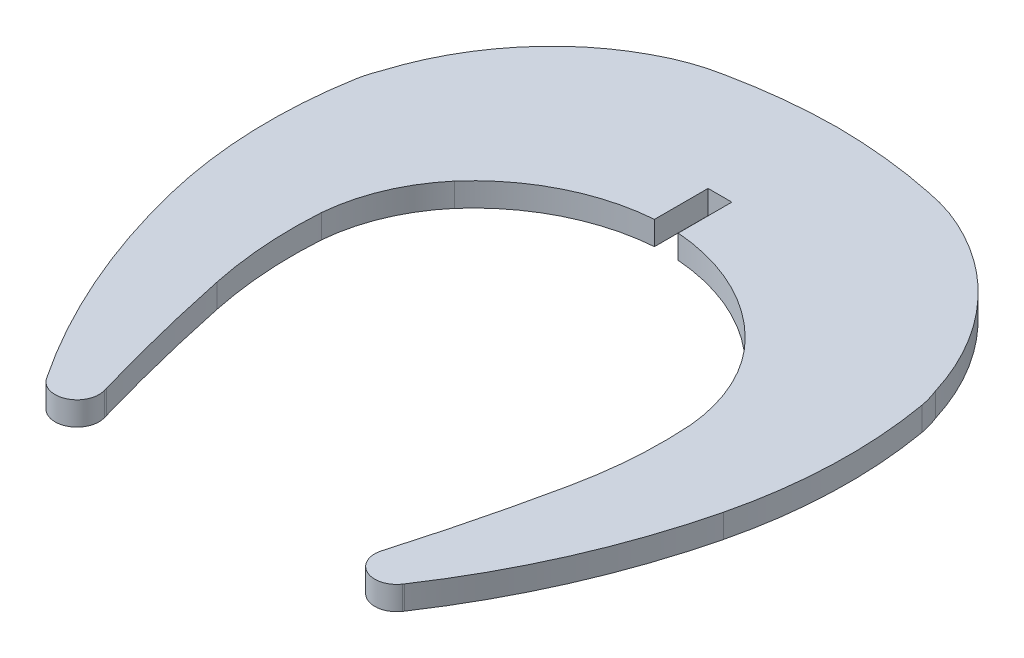
ISO-10303-21;
HEADER;
FILE_DESCRIPTION(('STEP AP214'),'2;1');
FILE_NAME('part.step','',(''),(''),'','','');
FILE_SCHEMA(('AUTOMOTIVE_DESIGN { 1 0 10303 214 1 1 1 1 }'));
ENDSEC;
DATA;
#1=APPLICATION_CONTEXT('core data for automotive mechanical design processes');
#2=APPLICATION_PROTOCOL_DEFINITION('international standard','automotive_design',2000,#1);
#3=PRODUCT_CONTEXT('',#1,'mechanical');
#4=PRODUCT('Part','Part','',(#3));
#5=PRODUCT_RELATED_PRODUCT_CATEGORY('part','',(#4));
#6=PRODUCT_DEFINITION_FORMATION('','',#4);
#7=PRODUCT_DEFINITION_CONTEXT('part definition',#1,'design');
#8=PRODUCT_DEFINITION('design','',#6,#7);
#9=PRODUCT_DEFINITION_SHAPE('','',#8);
#10=(LENGTH_UNIT() NAMED_UNIT(*) SI_UNIT(.MILLI.,.METRE.));
#11=(NAMED_UNIT(*) PLANE_ANGLE_UNIT() SI_UNIT($,.RADIAN.));
#12=(NAMED_UNIT(*) SI_UNIT($,.STERADIAN.) SOLID_ANGLE_UNIT());
#13=UNCERTAINTY_MEASURE_WITH_UNIT(LENGTH_MEASURE(1.E-05),#10,'distance_accuracy_value','');
#14=(GEOMETRIC_REPRESENTATION_CONTEXT(3) GLOBAL_UNCERTAINTY_ASSIGNED_CONTEXT((#13)) GLOBAL_UNIT_ASSIGNED_CONTEXT((#10,
#11,#12)) REPRESENTATION_CONTEXT('',''));
#15=CARTESIAN_POINT('',(0.,0.,0.));
#16=DIRECTION('',(0.,0.,1.));
#17=DIRECTION('',(1.,0.,0.));
#18=AXIS2_PLACEMENT_3D('',#15,#16,#17);
#19=CARTESIAN_POINT('',(180.345406971849,1.45,-372.869788526125));
#20=DIRECTION('',(0.,-1.,0.));
#21=DIRECTION('',(0.,0.,-1.));
#22=AXIS2_PLACEMENT_3D('',#19,#20,#21);
#23=CYLINDRICAL_SURFACE('',#22,10.6520191429131);
#24=CARTESIAN_POINT('',(180.345406971849,0.,-372.869788526125));
#25=DIRECTION('',(0.,1.,0.));
#26=DIRECTION('',(0.,0.,1.));
#27=AXIS2_PLACEMENT_3D('',#24,#25,#26);
#28=CIRCLE('',#27,10.6520191429131);
#29=CARTESIAN_POINT('',(184.776584593496,0.,-382.55638631412));
#30=VERTEX_POINT('',#29);
#31=CARTESIAN_POINT('',(182.253801492702,0.,-383.349461334651));
#32=VERTEX_POINT('',#31);
#33=EDGE_CURVE('E271',#30,#32,#28,.T.);
#34=ORIENTED_EDGE('',*,*,#33,.T.);
#35=DIRECTION('',(0.,-1.,0.));
#36=VECTOR('',#35,1.);
#37=CARTESIAN_POINT('',(182.253801492702,1.45,-383.349461334651));
#38=LINE('',#37,#36);
#39=CARTESIAN_POINT('',(182.253801492702,1.45,-383.349461334651));
#40=VERTEX_POINT('',#39);
#41=EDGE_CURVE('E11',#40,#32,#38,.T.);
#42=ORIENTED_EDGE('',*,*,#41,.F.);
#43=CARTESIAN_POINT('',(180.345406971849,1.45,-372.869788526125));
#44=DIRECTION('',(0.,1.,0.));
#45=DIRECTION('',(0.,0.,1.));
#46=AXIS2_PLACEMENT_3D('',#43,#44,#45);
#47=CIRCLE('',#46,10.6520191429131);
#48=CARTESIAN_POINT('',(184.776584593496,1.45,-382.55638631412));
#49=VERTEX_POINT('',#48);
#50=EDGE_CURVE('E344',#49,#40,#47,.T.);
#51=ORIENTED_EDGE('',*,*,#50,.F.);
#52=DIRECTION('',(0.,-1.,0.));
#53=VECTOR('',#52,1.);
#54=CARTESIAN_POINT('',(184.776584593496,1.45,-382.55638631412));
#55=LINE('',#54,#53);
#56=EDGE_CURVE('E267',#49,#30,#55,.T.);
#57=ORIENTED_EDGE('',*,*,#56,.T.);
#58=EDGE_LOOP('',(#34,#42,#51,#57));
#59=FACE_BOUND('',#58,.T.);
#60=ADVANCED_FACE('F37',(#59),#23,.T.);
#61=CARTESIAN_POINT('',(175.785924240257,1.45,-352.59396874766));
#62=DIRECTION('',(0.,-1.,0.));
#63=DIRECTION('',(0.,0.,-1.));
#64=AXIS2_PLACEMENT_3D('',#61,#62,#63);
#65=CYLINDRICAL_SURFACE('',#64,31.42823190097);
#66=CARTESIAN_POINT('',(175.785924240257,0.,-352.59396874766));
#67=DIRECTION('',(0.,1.,0.));
#68=DIRECTION('',(0.,0.,1.));
#69=AXIS2_PLACEMENT_3D('',#66,#67,#68);
#70=CIRCLE('',#69,31.42823190097);
#71=CARTESIAN_POINT('',(175.986030991978,0.,-384.021563592145));
#72=VERTEX_POINT('',#71);
#73=EDGE_CURVE('E274',#32,#72,#70,.T.);
#74=ORIENTED_EDGE('',*,*,#73,.T.);
#75=DIRECTION('',(0.,-1.,0.));
#76=VECTOR('',#75,1.);
#77=CARTESIAN_POINT('',(175.986030991978,1.45,-384.021563592145));
#78=LINE('',#77,#76);
#79=CARTESIAN_POINT('',(175.986030991978,1.45,-384.021563592145));
#80=VERTEX_POINT('',#79);
#81=EDGE_CURVE('E45',#80,#72,#78,.T.);
#82=ORIENTED_EDGE('',*,*,#81,.F.);
#83=CARTESIAN_POINT('',(175.785924240257,1.45,-352.59396874766));
#84=DIRECTION('',(0.,1.,0.));
#85=DIRECTION('',(0.,0.,1.));
#86=AXIS2_PLACEMENT_3D('',#83,#84,#85);
#87=CIRCLE('',#86,31.42823190097);
#88=EDGE_CURVE('E165',#40,#80,#87,.T.);
#89=ORIENTED_EDGE('',*,*,#88,.F.);
#90=ORIENTED_EDGE('',*,*,#41,.T.);
#91=EDGE_LOOP('',(#74,#82,#89,#90));
#92=FACE_BOUND('',#91,.T.);
#93=ADVANCED_FACE('F515',(#92),#65,.T.);
#94=CARTESIAN_POINT('',(176.186141083182,1.45,-352.593968768924));
#95=DIRECTION('',(0.,-1.,0.));
#96=DIRECTION('',(0.,0.,-1.));
#97=AXIS2_PLACEMENT_3D('',#94,#95,#96);
#98=CYLINDRICAL_SURFACE('',#97,31.42823190097);
#99=CARTESIAN_POINT('',(176.186141083182,0.,-352.593968768924));
#100=DIRECTION('',(0.,1.,0.));
#101=DIRECTION('',(0.,0.,1.));
#102=AXIS2_PLACEMENT_3D('',#99,#100,#101);
#103=CIRCLE('',#102,31.42823190097);
#104=CARTESIAN_POINT('',(169.718260957786,0.,-383.349460751733));
#105=VERTEX_POINT('',#104);
#106=EDGE_CURVE('E276',#72,#105,#103,.T.);
#107=ORIENTED_EDGE('',*,*,#106,.T.);
#108=DIRECTION('',(0.,-1.,0.));
#109=VECTOR('',#108,1.);
#110=CARTESIAN_POINT('',(169.718260957786,1.45,-383.349460751733));
#111=LINE('',#110,#109);
#112=CARTESIAN_POINT('',(169.718260957786,1.45,-383.349460751733));
#113=VERTEX_POINT('',#112);
#114=EDGE_CURVE('E407',#113,#105,#111,.T.);
#115=ORIENTED_EDGE('',*,*,#114,.F.);
#116=CARTESIAN_POINT('',(176.186141083182,1.45,-352.593968768924));
#117=DIRECTION('',(0.,1.,0.));
#118=DIRECTION('',(0.,0.,1.));
#119=AXIS2_PLACEMENT_3D('',#116,#117,#118);
#120=CIRCLE('',#119,31.42823190097);
#121=EDGE_CURVE('E415',#80,#113,#120,.T.);
#122=ORIENTED_EDGE('',*,*,#121,.F.);
#123=ORIENTED_EDGE('',*,*,#81,.T.);
#124=EDGE_LOOP('',(#107,#115,#122,#123));
#125=FACE_BOUND('',#124,.T.);
#126=ADVANCED_FACE('F413',(#125),#98,.T.);
#127=CARTESIAN_POINT('',(171.626656673033,1.45,-372.869788160711));
#128=DIRECTION('',(0.,-1.,0.));
#129=DIRECTION('',(0.,0.,-1.));
#130=AXIS2_PLACEMENT_3D('',#127,#128,#129);
#131=CYLINDRICAL_SURFACE('',#130,10.652019142913);
#132=CARTESIAN_POINT('',(171.626656673033,0.,-372.869788160711));
#133=DIRECTION('',(0.,1.,0.));
#134=DIRECTION('',(0.,0.,1.));
#135=AXIS2_PLACEMENT_3D('',#132,#133,#134);
#136=CIRCLE('',#135,10.652019142913);
#137=CARTESIAN_POINT('',(167.195478889347,0.,-382.556385874581));
#138=VERTEX_POINT('',#137);
#139=EDGE_CURVE('E278',#105,#138,#136,.T.);
#140=ORIENTED_EDGE('',*,*,#139,.T.);
#141=DIRECTION('',(0.,-1.,0.));
#142=VECTOR('',#141,1.);
#143=CARTESIAN_POINT('',(167.195478889347,1.45,-382.556385874581));
#144=LINE('',#143,#142);
#145=CARTESIAN_POINT('',(167.195478889347,1.45,-382.556385874581));
#146=VERTEX_POINT('',#145);
#147=EDGE_CURVE('E404',#146,#138,#144,.T.);
#148=ORIENTED_EDGE('',*,*,#147,.F.);
#149=CARTESIAN_POINT('',(171.626656673033,1.45,-372.869788160711));
#150=DIRECTION('',(0.,1.,0.));
#151=DIRECTION('',(0.,0.,1.));
#152=AXIS2_PLACEMENT_3D('',#149,#150,#151);
#153=CIRCLE('',#152,10.652019142913);
#154=EDGE_CURVE('E433',#113,#146,#153,.T.);
#155=ORIENTED_EDGE('',*,*,#154,.F.);
#156=ORIENTED_EDGE('',*,*,#114,.T.);
#157=EDGE_LOOP('',(#140,#148,#155,#156));
#158=FACE_BOUND('',#157,.T.);
#159=ADVANCED_FACE('F424',(#158),#131,.T.);
#160=CARTESIAN_POINT('',(173.240824016912,1.45,-369.341205010662));
#161=DIRECTION('',(0.,-1.,0.));
#162=DIRECTION('',(0.,0.,-1.));
#163=AXIS2_PLACEMENT_3D('',#160,#161,#162);
#164=CYLINDRICAL_SURFACE('',#163,14.532281409933);
#165=CARTESIAN_POINT('',(173.240824016912,0.,-369.341205010662));
#166=DIRECTION('',(0.,1.,0.));
#167=DIRECTION('',(0.,0.,1.));
#168=AXIS2_PLACEMENT_3D('',#165,#166,#167);
#169=CIRCLE('',#168,14.532281409933);
#170=CARTESIAN_POINT('',(163.339248716087,0.,-379.978216317395));
#171=VERTEX_POINT('',#170);
#172=EDGE_CURVE('E280',#138,#171,#169,.T.);
#173=ORIENTED_EDGE('',*,*,#172,.T.);
#174=DIRECTION('',(0.,-1.,0.));
#175=VECTOR('',#174,1.);
#176=CARTESIAN_POINT('',(163.339248716087,1.45,-379.978216317395));
#177=LINE('',#176,#175);
#178=CARTESIAN_POINT('',(163.339248716087,1.45,-379.978216317395));
#179=VERTEX_POINT('',#178);
#180=EDGE_CURVE('E401',#179,#171,#177,.T.);
#181=ORIENTED_EDGE('',*,*,#180,.F.);
#182=CARTESIAN_POINT('',(173.240824016912,1.45,-369.341205010662));
#183=DIRECTION('',(0.,1.,0.));
#184=DIRECTION('',(0.,0.,1.));
#185=AXIS2_PLACEMENT_3D('',#182,#183,#184);
#186=CIRCLE('',#185,14.532281409933);
#187=EDGE_CURVE('E430',#146,#179,#186,.T.);
#188=ORIENTED_EDGE('',*,*,#187,.F.);
#189=ORIENTED_EDGE('',*,*,#147,.T.);
#190=EDGE_LOOP('',(#173,#181,#188,#189));
#191=FACE_BOUND('',#190,.T.);
#192=ADVANCED_FACE('F428',(#191),#164,.T.);
#193=CARTESIAN_POINT('',(174.099127082395,1.45,-368.41915208441));
#194=DIRECTION('',(0.,-1.,0.));
#195=DIRECTION('',(0.,0.,-1.));
#196=AXIS2_PLACEMENT_3D('',#193,#194,#195);
#197=CYLINDRICAL_SURFACE('',#196,15.791990007596);
#198=CARTESIAN_POINT('',(174.099127082395,0.,-368.41915208441));
#199=DIRECTION('',(0.,1.,0.));
#200=DIRECTION('',(0.,0.,1.));
#201=AXIS2_PLACEMENT_3D('',#198,#199,#200);
#202=CIRCLE('',#201,15.791990007596);
#203=CARTESIAN_POINT('',(159.001266869177,0.,-373.049655877968));
#204=VERTEX_POINT('',#203);
#205=EDGE_CURVE('E282',#171,#204,#202,.T.);
#206=ORIENTED_EDGE('',*,*,#205,.T.);
#207=DIRECTION('',(0.,-1.,0.));
#208=VECTOR('',#207,1.);
#209=CARTESIAN_POINT('',(159.001266869177,1.45,-373.049655877968));
#210=LINE('',#209,#208);
#211=CARTESIAN_POINT('',(159.001266869177,1.45,-373.049655877968));
#212=VERTEX_POINT('',#211);
#213=EDGE_CURVE('E398',#212,#204,#210,.T.);
#214=ORIENTED_EDGE('',*,*,#213,.F.);
#215=CARTESIAN_POINT('',(174.099127082395,1.45,-368.41915208441));
#216=DIRECTION('',(0.,1.,0.));
#217=DIRECTION('',(0.,0.,1.));
#218=AXIS2_PLACEMENT_3D('',#215,#216,#217);
#219=CIRCLE('',#218,15.791990007596);
#220=EDGE_CURVE('E432',#179,#212,#219,.T.);
#221=ORIENTED_EDGE('',*,*,#220,.F.);
#222=ORIENTED_EDGE('',*,*,#180,.T.);
#223=EDGE_LOOP('',(#206,#214,#221,#222));
#224=FACE_BOUND('',#223,.T.);
#225=ADVANCED_FACE('F528',(#224),#197,.T.);
#226=CARTESIAN_POINT('',(164.583091733273,1.45,-370.77292843209));
#227=DIRECTION('',(0.,-1.,0.));
#228=DIRECTION('',(0.,0.,-1.));
#229=AXIS2_PLACEMENT_3D('',#226,#227,#228);
#230=CYLINDRICAL_SURFACE('',#229,6.02828803859342);
#231=CARTESIAN_POINT('',(164.583091733273,0.,-370.77292843209));
#232=DIRECTION('',(0.,1.,0.));
#233=DIRECTION('',(0.,0.,1.));
#234=AXIS2_PLACEMENT_3D('',#231,#232,#233);
#235=CIRCLE('',#234,6.02828803859342);
#236=CARTESIAN_POINT('',(158.652349766364,0.,-371.853000836234));
#237=VERTEX_POINT('',#236);
#238=EDGE_CURVE('E284',#204,#237,#235,.T.);
#239=ORIENTED_EDGE('',*,*,#238,.T.);
#240=DIRECTION('',(0.,-1.,0.));
#241=VECTOR('',#240,1.);
#242=CARTESIAN_POINT('',(158.652349766364,1.45,-371.853000836234));
#243=LINE('',#242,#241);
#244=CARTESIAN_POINT('',(158.652349766364,1.45,-371.853000836234));
#245=VERTEX_POINT('',#244);
#246=EDGE_CURVE('E395',#245,#237,#243,.T.);
#247=ORIENTED_EDGE('',*,*,#246,.F.);
#248=CARTESIAN_POINT('',(164.583091733273,1.45,-370.77292843209));
#249=DIRECTION('',(0.,1.,0.));
#250=DIRECTION('',(0.,0.,1.));
#251=AXIS2_PLACEMENT_3D('',#248,#249,#250);
#252=CIRCLE('',#251,6.02828803859342);
#253=EDGE_CURVE('E435',#212,#245,#252,.T.);
#254=ORIENTED_EDGE('',*,*,#253,.F.);
#255=ORIENTED_EDGE('',*,*,#213,.T.);
#256=EDGE_LOOP('',(#239,#247,#254,#255));
#257=FACE_BOUND('',#256,.T.);
#258=ADVANCED_FACE('F531',(#257),#230,.T.);
#259=CARTESIAN_POINT('',(187.055616498486,1.45,-366.945503821736));
#260=DIRECTION('',(0.,-1.,0.));
#261=DIRECTION('',(0.,0.,-1.));
#262=AXIS2_PLACEMENT_3D('',#259,#260,#261);
#263=CYLINDRICAL_SURFACE('',#262,28.824106022623);
#264=CARTESIAN_POINT('',(187.055616498486,0.,-366.945503821736));
#265=DIRECTION('',(0.,1.,0.));
#266=DIRECTION('',(0.,0.,1.));
#267=AXIS2_PLACEMENT_3D('',#264,#265,#266);
#268=CIRCLE('',#267,28.824106022623);
#269=CARTESIAN_POINT('',(159.055612028446,0.,-360.102343902434));
#270=VERTEX_POINT('',#269);
#271=EDGE_CURVE('E286',#237,#270,#268,.T.);
#272=ORIENTED_EDGE('',*,*,#271,.T.);
#273=DIRECTION('',(0.,-1.,0.));
#274=VECTOR('',#273,1.);
#275=CARTESIAN_POINT('',(159.055612028446,1.45,-360.102343902434));
#276=LINE('',#275,#274);
#277=CARTESIAN_POINT('',(159.055612028446,1.45,-360.102343902434));
#278=VERTEX_POINT('',#277);
#279=EDGE_CURVE('E392',#278,#270,#276,.T.);
#280=ORIENTED_EDGE('',*,*,#279,.F.);
#281=CARTESIAN_POINT('',(187.055616498486,1.45,-366.945503821736));
#282=DIRECTION('',(0.,1.,0.));
#283=DIRECTION('',(0.,0.,1.));
#284=AXIS2_PLACEMENT_3D('',#281,#282,#283);
#285=CIRCLE('',#284,28.824106022623);
#286=EDGE_CURVE('E441',#245,#278,#285,.T.);
#287=ORIENTED_EDGE('',*,*,#286,.F.);
#288=ORIENTED_EDGE('',*,*,#246,.T.);
#289=EDGE_LOOP('',(#272,#280,#287,#288));
#290=FACE_BOUND('',#289,.T.);
#291=ADVANCED_FACE('F535',(#290),#263,.T.);
#292=CARTESIAN_POINT('',(200.557370850934,1.45,-370.24531142033));
#293=DIRECTION('',(0.,-1.,0.));
#294=DIRECTION('',(0.,0.,-1.));
#295=AXIS2_PLACEMENT_3D('',#292,#293,#294);
#296=CYLINDRICAL_SURFACE('',#295,42.723246311921);
#297=CARTESIAN_POINT('',(200.557370850934,0.,-370.24531142033));
#298=DIRECTION('',(0.,1.,0.));
#299=DIRECTION('',(0.,0.,1.));
#300=AXIS2_PLACEMENT_3D('',#297,#298,#299);
#301=CIRCLE('',#300,42.723246311921);
#302=CARTESIAN_POINT('',(165.027570185966,0.,-346.519607212938));
#303=VERTEX_POINT('',#302);
#304=EDGE_CURVE('E288',#270,#303,#301,.T.);
#305=ORIENTED_EDGE('',*,*,#304,.T.);
#306=DIRECTION('',(0.,-1.,0.));
#307=VECTOR('',#306,1.);
#308=CARTESIAN_POINT('',(165.027570185966,1.45,-346.519607212938));
#309=LINE('',#308,#307);
#310=CARTESIAN_POINT('',(165.027570185966,1.45,-346.519607212938));
#311=VERTEX_POINT('',#310);
#312=EDGE_CURVE('E389',#311,#303,#309,.T.);
#313=ORIENTED_EDGE('',*,*,#312,.F.);
#314=CARTESIAN_POINT('',(200.557370850934,1.45,-370.24531142033));
#315=DIRECTION('',(0.,1.,0.));
#316=DIRECTION('',(0.,0.,1.));
#317=AXIS2_PLACEMENT_3D('',#314,#315,#316);
#318=CIRCLE('',#317,42.723246311921);
#319=EDGE_CURVE('E443',#278,#311,#318,.T.);
#320=ORIENTED_EDGE('',*,*,#319,.F.);
#321=ORIENTED_EDGE('',*,*,#279,.T.);
#322=EDGE_LOOP('',(#305,#313,#320,#321));
#323=FACE_BOUND('',#322,.T.);
#324=ADVANCED_FACE('F539',(#323),#296,.T.);
#325=CARTESIAN_POINT('',(135.836235643993,1.45,-390.148773932279));
#326=DIRECTION('',(0.831123993579579,0.,-0.556087140020638));
#327=DIRECTION('',(-0.556087140020638,0.,-0.831123993579579));
#328=AXIS2_PLACEMENT_3D('',#325,#326,#327);
#329=PLANE('',#328);
#330=DIRECTION('',(0.556087140020638,0.,0.831123993579579));
#331=VECTOR('',#330,1.);
#332=CARTESIAN_POINT('',(135.836235643993,0.,-390.148773932279));
#333=LINE('',#332,#331);
#334=CARTESIAN_POINT('',(165.0706141363,0.,-346.45527402246));
#335=VERTEX_POINT('',#334);
#336=EDGE_CURVE('E290',#303,#335,#333,.T.);
#337=ORIENTED_EDGE('',*,*,#336,.T.);
#338=DIRECTION('',(0.,-1.,0.));
#339=VECTOR('',#338,1.);
#340=CARTESIAN_POINT('',(165.0706141363,1.45,-346.45527402246));
#341=LINE('',#340,#339);
#342=CARTESIAN_POINT('',(165.0706141363,1.45,-346.45527402246));
#343=VERTEX_POINT('',#342);
#344=EDGE_CURVE('E386',#343,#335,#341,.T.);
#345=ORIENTED_EDGE('',*,*,#344,.F.);
#346=DIRECTION('',(0.556087140020638,0.,0.831123993579579));
#347=VECTOR('',#346,1.);
#348=CARTESIAN_POINT('',(135.836235643993,1.45,-390.148773932279));
#349=LINE('',#348,#347);
#350=EDGE_CURVE('E445',#311,#343,#349,.T.);
#351=ORIENTED_EDGE('',*,*,#350,.F.);
#352=ORIENTED_EDGE('',*,*,#312,.T.);
#353=EDGE_LOOP('',(#337,#345,#351,#352));
#354=FACE_BOUND('',#353,.T.);
#355=ADVANCED_FACE('F543',(#354),#329,.F.);
#356=CARTESIAN_POINT('',(166.189287382177,1.45,-347.205223201937));
#357=DIRECTION('',(0.,-1.,0.));
#358=DIRECTION('',(0.,0.,-1.));
#359=AXIS2_PLACEMENT_3D('',#356,#357,#358);
#360=CYLINDRICAL_SURFACE('',#359,1.3467938234335);
#361=CARTESIAN_POINT('',(166.189287382177,0.,-347.205223201937));
#362=DIRECTION('',(0.,1.,0.));
#363=DIRECTION('',(0.,0.,1.));
#364=AXIS2_PLACEMENT_3D('',#361,#362,#363);
#365=CIRCLE('',#364,1.3467938234335);
#366=CARTESIAN_POINT('',(167.482738023706,0.,-347.580508481113));
#367=VERTEX_POINT('',#366);
#368=EDGE_CURVE('E292',#335,#367,#365,.T.);
#369=ORIENTED_EDGE('',*,*,#368,.T.);
#370=DIRECTION('',(0.,-1.,0.));
#371=VECTOR('',#370,1.);
#372=CARTESIAN_POINT('',(167.482738023706,1.45,-347.580508481113));
#373=LINE('',#372,#371);
#374=CARTESIAN_POINT('',(167.482738023706,1.45,-347.580508481113));
#375=VERTEX_POINT('',#374);
#376=EDGE_CURVE('E384',#375,#367,#373,.T.);
#377=ORIENTED_EDGE('',*,*,#376,.F.);
#378=CARTESIAN_POINT('',(166.189287382177,1.45,-347.205223201937));
#379=DIRECTION('',(0.,1.,0.));
#380=DIRECTION('',(0.,0.,1.));
#381=AXIS2_PLACEMENT_3D('',#378,#379,#380);
#382=CIRCLE('',#381,1.3467938234335);
#383=EDGE_CURVE('E447',#343,#375,#382,.T.);
#384=ORIENTED_EDGE('',*,*,#383,.F.);
#385=ORIENTED_EDGE('',*,*,#344,.T.);
#386=EDGE_LOOP('',(#369,#377,#384,#385));
#387=FACE_BOUND('',#386,.T.);
#388=ADVANCED_FACE('F547',(#387),#360,.T.);
#389=CARTESIAN_POINT('',(172.312816323517,1.45,-330.933193670172));
#390=DIRECTION('',(0.960392756361393,0.,-0.278649876239996));
#391=DIRECTION('',(-0.278649876239996,0.,-0.960392756361393));
#392=AXIS2_PLACEMENT_3D('',#389,#390,#391);
#393=PLANE('',#392);
#394=DIRECTION('',(0.278649876239996,0.,0.960392756361394));
#395=VECTOR('',#394,1.);
#396=CARTESIAN_POINT('',(172.312816323517,0.,-330.933193670172));
#397=LINE('',#396,#395);
#398=CARTESIAN_POINT('',(167.432234608628,0.,-347.754573205875));
#399=VERTEX_POINT('',#398);
#400=EDGE_CURVE('E295',#399,#367,#397,.T.);
#401=ORIENTED_EDGE('',*,*,#400,.F.);
#402=DIRECTION('',(0.,-1.,0.));
#403=VECTOR('',#402,1.);
#404=CARTESIAN_POINT('',(167.432234608628,1.45,-347.754573205875));
#405=LINE('',#404,#403);
#406=CARTESIAN_POINT('',(167.432234608628,1.45,-347.754573205875));
#407=VERTEX_POINT('',#406);
#408=EDGE_CURVE('E382',#407,#399,#405,.T.);
#409=ORIENTED_EDGE('',*,*,#408,.F.);
#410=DIRECTION('',(0.278649876239996,0.,0.960392756361394));
#411=VECTOR('',#410,1.);
#412=CARTESIAN_POINT('',(172.312816323517,1.45,-330.933193670172));
#413=LINE('',#412,#411);
#414=EDGE_CURVE('E449',#407,#375,#413,.T.);
#415=ORIENTED_EDGE('',*,*,#414,.T.);
#416=ORIENTED_EDGE('',*,*,#376,.T.);
#417=EDGE_LOOP('',(#401,#409,#415,#416));
#418=FACE_BOUND('',#417,.T.);
#419=ADVANCED_FACE('F551',(#418),#393,.T.);
#420=CARTESIAN_POINT('',(287.517532420973,1.45,-382.502321942708));
#421=DIRECTION('',(0.,-1.,0.));
#422=DIRECTION('',(0.,0.,-1.));
#423=AXIS2_PLACEMENT_3D('',#420,#421,#422);
#424=CYLINDRICAL_SURFACE('',#423,125.01153863927);
#425=CARTESIAN_POINT('',(287.517532420973,0.,-382.502321942708));
#426=DIRECTION('',(0.,1.,0.));
#427=DIRECTION('',(0.,0.,1.));
#428=AXIS2_PLACEMENT_3D('',#425,#426,#427);
#429=CIRCLE('',#428,125.01153863927);
#430=CARTESIAN_POINT('',(165.178499538514,0.,-356.791510474724));
#431=VERTEX_POINT('',#430);
#432=EDGE_CURVE('E298',#431,#399,#429,.T.);
#433=ORIENTED_EDGE('',*,*,#432,.F.);
#434=DIRECTION('',(0.,-1.,0.));
#435=VECTOR('',#434,1.);
#436=CARTESIAN_POINT('',(165.178499538514,1.45,-356.791510474724));
#437=LINE('',#436,#435);
#438=CARTESIAN_POINT('',(165.178499538514,1.45,-356.791510474724));
#439=VERTEX_POINT('',#438);
#440=EDGE_CURVE('E380',#439,#431,#437,.T.);
#441=ORIENTED_EDGE('',*,*,#440,.F.);
#442=CARTESIAN_POINT('',(287.517532420973,1.45,-382.502321942708));
#443=DIRECTION('',(0.,1.,0.));
#444=DIRECTION('',(0.,0.,1.));
#445=AXIS2_PLACEMENT_3D('',#442,#443,#444);
#446=CIRCLE('',#445,125.01153863927);
#447=EDGE_CURVE('E452',#439,#407,#446,.T.);
#448=ORIENTED_EDGE('',*,*,#447,.T.);
#449=ORIENTED_EDGE('',*,*,#408,.T.);
#450=EDGE_LOOP('',(#433,#441,#448,#449));
#451=FACE_BOUND('',#450,.T.);
#452=ADVANCED_FACE('F555',(#451),#424,.F.);
#453=CARTESIAN_POINT('',(189.972544062798,1.45,-362.002235557524));
#454=DIRECTION('',(0.,-1.,0.));
#455=DIRECTION('',(0.,0.,-1.));
#456=AXIS2_PLACEMENT_3D('',#453,#454,#455);
#457=CYLINDRICAL_SURFACE('',#456,25.335672475005);
#458=CARTESIAN_POINT('',(189.972544062798,0.,-362.002235557524));
#459=DIRECTION('',(0.,1.,0.));
#460=DIRECTION('',(0.,0.,1.));
#461=AXIS2_PLACEMENT_3D('',#458,#459,#460);
#462=CIRCLE('',#461,25.335672475005);
#463=CARTESIAN_POINT('',(164.692460186615,0.,-363.679632044304));
#464=VERTEX_POINT('',#463);
#465=EDGE_CURVE('E301',#464,#431,#462,.T.);
#466=ORIENTED_EDGE('',*,*,#465,.F.);
#467=DIRECTION('',(0.,-1.,0.));
#468=VECTOR('',#467,1.);
#469=CARTESIAN_POINT('',(164.692460186615,1.45,-363.679632044304));
#470=LINE('',#469,#468);
#471=CARTESIAN_POINT('',(164.692460186615,1.45,-363.679632044304));
#472=VERTEX_POINT('',#471);
#473=EDGE_CURVE('E378',#472,#464,#470,.T.);
#474=ORIENTED_EDGE('',*,*,#473,.F.);
#475=CARTESIAN_POINT('',(189.972544062798,1.45,-362.002235557524));
#476=DIRECTION('',(0.,1.,0.));
#477=DIRECTION('',(0.,0.,1.));
#478=AXIS2_PLACEMENT_3D('',#475,#476,#477);
#479=CIRCLE('',#478,25.335672475005);
#480=EDGE_CURVE('E455',#472,#439,#479,.T.);
#481=ORIENTED_EDGE('',*,*,#480,.T.);
#482=ORIENTED_EDGE('',*,*,#440,.T.);
#483=EDGE_LOOP('',(#466,#474,#481,#482));
#484=FACE_BOUND('',#483,.T.);
#485=ADVANCED_FACE('F559',(#484),#457,.F.);
#486=CARTESIAN_POINT('',(174.879965888206,1.45,-362.800290793775));
#487=DIRECTION('',(0.,-1.,0.));
#488=DIRECTION('',(0.,0.,-1.));
#489=AXIS2_PLACEMENT_3D('',#486,#487,#488);
#490=CYLINDRICAL_SURFACE('',#489,10.225385736237);
#491=CARTESIAN_POINT('',(174.879965888206,0.,-362.800290793775));
#492=DIRECTION('',(0.,1.,0.));
#493=DIRECTION('',(0.,0.,1.));
#494=AXIS2_PLACEMENT_3D('',#491,#492,#493);
#495=CIRCLE('',#494,10.225385736237);
#496=CARTESIAN_POINT('',(167.100236374237,0.,-369.436126999131));
#497=VERTEX_POINT('',#496);
#498=EDGE_CURVE('E304',#497,#464,#495,.T.);
#499=ORIENTED_EDGE('',*,*,#498,.F.);
#500=DIRECTION('',(0.,-1.,0.));
#501=VECTOR('',#500,1.);
#502=CARTESIAN_POINT('',(167.100236374237,1.45,-369.436126999131));
#503=LINE('',#502,#501);
#504=CARTESIAN_POINT('',(167.100236374237,1.45,-369.436126999131));
#505=VERTEX_POINT('',#504);
#506=EDGE_CURVE('E376',#505,#497,#503,.T.);
#507=ORIENTED_EDGE('',*,*,#506,.F.);
#508=CARTESIAN_POINT('',(174.879965888206,1.45,-362.800290793775));
#509=DIRECTION('',(0.,1.,0.));
#510=DIRECTION('',(0.,0.,1.));
#511=AXIS2_PLACEMENT_3D('',#508,#509,#510);
#512=CIRCLE('',#511,10.225385736237);
#513=EDGE_CURVE('E458',#505,#472,#512,.T.);
#514=ORIENTED_EDGE('',*,*,#513,.T.);
#515=ORIENTED_EDGE('',*,*,#473,.T.);
#516=EDGE_LOOP('',(#499,#507,#514,#515));
#517=FACE_BOUND('',#516,.T.);
#518=ADVANCED_FACE('F563',(#517),#490,.F.);
#519=CARTESIAN_POINT('',(176.189203549258,1.45,-361.495435994717));
#520=DIRECTION('',(0.,-1.,0.));
#521=DIRECTION('',(0.,0.,-1.));
#522=AXIS2_PLACEMENT_3D('',#519,#520,#521);
#523=CYLINDRICAL_SURFACE('',#522,12.069129957714);
#524=CARTESIAN_POINT('',(176.189203549258,0.,-361.495435994717));
#525=DIRECTION('',(0.,1.,0.));
#526=DIRECTION('',(0.,0.,1.));
#527=AXIS2_PLACEMENT_3D('',#524,#525,#526);
#528=CIRCLE('',#527,12.069129957714);
#529=CARTESIAN_POINT('',(175.25703137545,0.,-373.52851344708));
#530=VERTEX_POINT('',#529);
#531=EDGE_CURVE('E307',#530,#497,#528,.T.);
#532=ORIENTED_EDGE('',*,*,#531,.F.);
#533=DIRECTION('',(0.,-1.,0.));
#534=VECTOR('',#533,1.);
#535=CARTESIAN_POINT('',(175.25703137545,1.45,-373.52851344708));
#536=LINE('',#535,#534);
#537=CARTESIAN_POINT('',(175.25703137545,1.45,-373.52851344708));
#538=VERTEX_POINT('',#537);
#539=EDGE_CURVE('E374',#538,#530,#536,.T.);
#540=ORIENTED_EDGE('',*,*,#539,.F.);
#541=CARTESIAN_POINT('',(176.189203549258,1.45,-361.495435994717));
#542=DIRECTION('',(0.,1.,0.));
#543=DIRECTION('',(0.,0.,1.));
#544=AXIS2_PLACEMENT_3D('',#541,#542,#543);
#545=CIRCLE('',#544,12.069129957714);
#546=EDGE_CURVE('E461',#538,#505,#545,.T.);
#547=ORIENTED_EDGE('',*,*,#546,.T.);
#548=ORIENTED_EDGE('',*,*,#506,.T.);
#549=EDGE_LOOP('',(#532,#540,#547,#548));
#550=FACE_BOUND('',#549,.T.);
#551=ADVANCED_FACE('F567',(#550),#523,.F.);
#552=CARTESIAN_POINT('',(175.25703137545,1.45,-266.906670720934));
#553=DIRECTION('',(-1.,0.,0.));
#554=DIRECTION('',(0.,0.,1.));
#555=AXIS2_PLACEMENT_3D('',#552,#553,#554);
#556=PLANE('',#555);
#557=DIRECTION('',(0.,0.,-1.));
#558=VECTOR('',#557,1.);
#559=CARTESIAN_POINT('',(175.25703137545,0.,-266.906670720934));
#560=LINE('',#559,#558);
#561=CARTESIAN_POINT('',(175.25703137545,0.,-376.81462228758));
#562=VERTEX_POINT('',#561);
#563=EDGE_CURVE('E310',#530,#562,#560,.T.);
#564=ORIENTED_EDGE('',*,*,#563,.T.);
#565=DIRECTION('',(0.,-1.,0.));
#566=VECTOR('',#565,1.);
#567=CARTESIAN_POINT('',(175.25703137545,1.45,-376.81462228758));
#568=LINE('',#567,#566);
#569=CARTESIAN_POINT('',(175.25703137545,1.45,-376.81462228758));
#570=VERTEX_POINT('',#569);
#571=EDGE_CURVE('E371',#570,#562,#568,.T.);
#572=ORIENTED_EDGE('',*,*,#571,.F.);
#573=DIRECTION('',(0.,0.,-1.));
#574=VECTOR('',#573,1.);
#575=CARTESIAN_POINT('',(175.25703137545,1.45,-266.906670720934));
#576=LINE('',#575,#574);
#577=EDGE_CURVE('E464',#538,#570,#576,.T.);
#578=ORIENTED_EDGE('',*,*,#577,.F.);
#579=ORIENTED_EDGE('',*,*,#539,.T.);
#580=EDGE_LOOP('',(#564,#572,#578,#579));
#581=FACE_BOUND('',#580,.T.);
#582=ADVANCED_FACE('F571',(#581),#556,.F.);
#583=CARTESIAN_POINT('',(-48.360559474051,1.45,-376.81462228758));
#584=DIRECTION('',(0.,0.,-1.));
#585=DIRECTION('',(-1.,0.,0.));
#586=AXIS2_PLACEMENT_3D('',#583,#584,#585);
#587=PLANE('',#586);
#588=DIRECTION('',(1.,0.,0.));
#589=VECTOR('',#588,1.);
#590=CARTESIAN_POINT('',(-48.360559474051,0.,-376.81462228758));
#591=LINE('',#590,#589);
#592=CARTESIAN_POINT('',(176.71503306256,0.,-376.81462228758));
#593=VERTEX_POINT('',#592);
#594=EDGE_CURVE('E312',#562,#593,#591,.T.);
#595=ORIENTED_EDGE('',*,*,#594,.T.);
#596=DIRECTION('',(0.,-1.,0.));
#597=VECTOR('',#596,1.);
#598=CARTESIAN_POINT('',(176.71503306256,1.45,-376.81462228758));
#599=LINE('',#598,#597);
#600=CARTESIAN_POINT('',(176.71503306256,1.45,-376.81462228758));
#601=VERTEX_POINT('',#600);
#602=EDGE_CURVE('E369',#601,#593,#599,.T.);
#603=ORIENTED_EDGE('',*,*,#602,.F.);
#604=DIRECTION('',(1.,0.,0.));
#605=VECTOR('',#604,1.);
#606=CARTESIAN_POINT('',(-48.360559474051,1.45,-376.81462228758));
#607=LINE('',#606,#605);
#608=EDGE_CURVE('E466',#570,#601,#607,.T.);
#609=ORIENTED_EDGE('',*,*,#608,.F.);
#610=ORIENTED_EDGE('',*,*,#571,.T.);
#611=EDGE_LOOP('',(#595,#603,#609,#610));
#612=FACE_BOUND('',#611,.T.);
#613=ADVANCED_FACE('F575',(#612),#587,.F.);
#614=CARTESIAN_POINT('',(176.715022756599,1.45,-266.90664961582));
#615=DIRECTION('',(-0.999999999999995,0.,-9.37690053669793E-08));
#616=DIRECTION('',(-9.37690053669793E-08,0.,0.999999999999996));
#617=AXIS2_PLACEMENT_3D('',#614,#615,#616);
#618=PLANE('',#617);
#619=DIRECTION('',(9.37690053669793E-08,0.,-0.999999999999996));
#620=VECTOR('',#619,1.);
#621=CARTESIAN_POINT('',(176.715022756599,0.,-266.90664961582));
#622=LINE('',#621,#620);
#623=CARTESIAN_POINT('',(176.715032754425,0.,-373.52851346011));
#624=VERTEX_POINT('',#623);
#625=EDGE_CURVE('E315',#624,#593,#622,.T.);
#626=ORIENTED_EDGE('',*,*,#625,.F.);
#627=DIRECTION('',(0.,-1.,0.));
#628=VECTOR('',#627,1.);
#629=CARTESIAN_POINT('',(176.715032754425,1.45,-373.52851346011));
#630=LINE('',#629,#628);
#631=CARTESIAN_POINT('',(176.715032754425,1.45,-373.52851346011));
#632=VERTEX_POINT('',#631);
#633=EDGE_CURVE('E367',#632,#624,#630,.T.);
#634=ORIENTED_EDGE('',*,*,#633,.F.);
#635=DIRECTION('',(9.37690053669793E-08,0.,-0.999999999999996));
#636=VECTOR('',#635,1.);
#637=CARTESIAN_POINT('',(176.715022756599,1.45,-266.90664961582));
#638=LINE('',#637,#636);
#639=EDGE_CURVE('E468',#632,#601,#638,.T.);
#640=ORIENTED_EDGE('',*,*,#639,.T.);
#641=ORIENTED_EDGE('',*,*,#602,.T.);
#642=EDGE_LOOP('',(#626,#634,#640,#641));
#643=FACE_BOUND('',#642,.T.);
#644=ADVANCED_FACE('F579',(#643),#618,.T.);
#645=CARTESIAN_POINT('',(175.782860637734,1.45,-361.495436003323));
#646=DIRECTION('',(0.,-1.,0.));
#647=DIRECTION('',(0.,0.,-1.));
#648=AXIS2_PLACEMENT_3D('',#645,#646,#647);
#649=CYLINDRICAL_SURFACE('',#648,12.069129957714);
#650=CARTESIAN_POINT('',(175.782860637734,0.,-361.495436003323));
#651=DIRECTION('',(0.,1.,0.));
#652=DIRECTION('',(0.,0.,1.));
#653=AXIS2_PLACEMENT_3D('',#650,#651,#652);
#654=CIRCLE('',#653,12.069129957714);
#655=CARTESIAN_POINT('',(184.871827212701,0.,-369.436127694562));
#656=VERTEX_POINT('',#655);
#657=EDGE_CURVE('E318',#656,#624,#654,.T.);
#658=ORIENTED_EDGE('',*,*,#657,.F.);
#659=DIRECTION('',(0.,-1.,0.));
#660=VECTOR('',#659,1.);
#661=CARTESIAN_POINT('',(184.871827212701,1.45,-369.436127694562));
#662=LINE('',#661,#660);
#663=CARTESIAN_POINT('',(184.871827212701,1.45,-369.436127694562));
#664=VERTEX_POINT('',#663);
#665=EDGE_CURVE('E365',#664,#656,#662,.T.);
#666=ORIENTED_EDGE('',*,*,#665,.F.);
#667=CARTESIAN_POINT('',(175.782860637734,1.45,-361.495436003323));
#668=DIRECTION('',(0.,1.,0.));
#669=DIRECTION('',(0.,0.,1.));
#670=AXIS2_PLACEMENT_3D('',#667,#668,#669);
#671=CIRCLE('',#670,12.069129957714);
#672=EDGE_CURVE('E471',#664,#632,#671,.T.);
#673=ORIENTED_EDGE('',*,*,#672,.T.);
#674=ORIENTED_EDGE('',*,*,#633,.T.);
#675=EDGE_LOOP('',(#658,#666,#673,#674));
#676=FACE_BOUND('',#675,.T.);
#677=ADVANCED_FACE('F583',(#676),#649,.F.);
#678=CARTESIAN_POINT('',(177.092098940263,1.45,-362.800290408106));
#679=DIRECTION('',(0.,-1.,0.));
#680=DIRECTION('',(0.,0.,-1.));
#681=AXIS2_PLACEMENT_3D('',#678,#679,#680);
#682=CYLINDRICAL_SURFACE('',#681,10.225385493237);
#683=CARTESIAN_POINT('',(177.092098940263,0.,-362.800290408106));
#684=DIRECTION('',(0.,1.,0.));
#685=DIRECTION('',(0.,0.,1.));
#686=AXIS2_PLACEMENT_3D('',#683,#684,#685);
#687=CIRCLE('',#686,10.225385493237);
#688=CARTESIAN_POINT('',(187.279604298166,0.,-363.67963281468));
#689=VERTEX_POINT('',#688);
#690=EDGE_CURVE('E321',#689,#656,#687,.T.);
#691=ORIENTED_EDGE('',*,*,#690,.F.);
#692=DIRECTION('',(0.,-1.,0.));
#693=VECTOR('',#692,1.);
#694=CARTESIAN_POINT('',(187.279604298166,1.45,-363.67963281468));
#695=LINE('',#694,#693);
#696=CARTESIAN_POINT('',(187.279604298166,1.45,-363.67963281468));
#697=VERTEX_POINT('',#696);
#698=EDGE_CURVE('E363',#697,#689,#695,.T.);
#699=ORIENTED_EDGE('',*,*,#698,.F.);
#700=CARTESIAN_POINT('',(177.092098940263,1.45,-362.800290408106));
#701=DIRECTION('',(0.,1.,0.));
#702=DIRECTION('',(0.,0.,1.));
#703=AXIS2_PLACEMENT_3D('',#700,#701,#702);
#704=CIRCLE('',#703,10.225385493237);
#705=EDGE_CURVE('E474',#697,#664,#704,.T.);
#706=ORIENTED_EDGE('',*,*,#705,.T.);
#707=ORIENTED_EDGE('',*,*,#665,.T.);
#708=EDGE_LOOP('',(#691,#699,#706,#707));
#709=FACE_BOUND('',#708,.T.);
#710=ADVANCED_FACE('F587',(#709),#682,.F.);
#711=CARTESIAN_POINT('',(161.999520429134,1.45,-362.002236220121));
#712=DIRECTION('',(0.,-1.,0.));
#713=DIRECTION('',(0.,0.,-1.));
#714=AXIS2_PLACEMENT_3D('',#711,#712,#713);
#715=CYLINDRICAL_SURFACE('',#714,25.335672475005);
#716=CARTESIAN_POINT('',(161.999520429134,0.,-362.002236220121));
#717=DIRECTION('',(0.,1.,0.));
#718=DIRECTION('',(0.,0.,1.));
#719=AXIS2_PLACEMENT_3D('',#716,#717,#718);
#720=CIRCLE('',#719,25.335672475005);
#721=CARTESIAN_POINT('',(186.793565283891,0.,-356.791512709798));
#722=VERTEX_POINT('',#721);
#723=EDGE_CURVE('E324',#722,#689,#720,.T.);
#724=ORIENTED_EDGE('',*,*,#723,.F.);
#725=DIRECTION('',(0.,-1.,0.));
#726=VECTOR('',#725,1.);
#727=CARTESIAN_POINT('',(186.793565283891,1.45,-356.791512709798));
#728=LINE('',#727,#726);
#729=CARTESIAN_POINT('',(186.793565283891,1.45,-356.791512709798));
#730=VERTEX_POINT('',#729);
#731=EDGE_CURVE('E361',#730,#722,#728,.T.);
#732=ORIENTED_EDGE('',*,*,#731,.F.);
#733=CARTESIAN_POINT('',(161.999520429134,1.45,-362.002236220121));
#734=DIRECTION('',(0.,1.,0.));
#735=DIRECTION('',(0.,0.,1.));
#736=AXIS2_PLACEMENT_3D('',#733,#734,#735);
#737=CIRCLE('',#736,25.335672475005);
#738=EDGE_CURVE('E477',#730,#697,#737,.T.);
#739=ORIENTED_EDGE('',*,*,#738,.T.);
#740=ORIENTED_EDGE('',*,*,#698,.T.);
#741=EDGE_LOOP('',(#724,#732,#739,#740));
#742=FACE_BOUND('',#741,.T.);
#743=ADVANCED_FACE('F591',(#742),#715,.F.);
#744=CARTESIAN_POINT('',(64.4545307569675,1.45,-382.502317534492));
#745=DIRECTION('',(0.,-1.,0.));
#746=DIRECTION('',(0.,0.,-1.));
#747=AXIS2_PLACEMENT_3D('',#744,#745,#746);
#748=CYLINDRICAL_SURFACE('',#747,125.01153888227);
#749=CARTESIAN_POINT('',(64.4545307569675,0.,-382.502317534492));
#750=DIRECTION('',(0.,1.,0.));
#751=DIRECTION('',(0.,0.,1.));
#752=AXIS2_PLACEMENT_3D('',#749,#750,#751);
#753=CIRCLE('',#752,125.01153888227);
#754=CARTESIAN_POINT('',(184.53982728297,0.,-347.754563477932));
#755=VERTEX_POINT('',#754);
#756=EDGE_CURVE('E327',#755,#722,#753,.T.);
#757=ORIENTED_EDGE('',*,*,#756,.F.);
#758=DIRECTION('',(0.,-1.,0.));
#759=VECTOR('',#758,1.);
#760=CARTESIAN_POINT('',(184.53982728297,1.45,-347.754563477932));
#761=LINE('',#760,#759);
#762=CARTESIAN_POINT('',(184.53982728297,1.45,-347.754563477932));
#763=VERTEX_POINT('',#762);
#764=EDGE_CURVE('E359',#763,#755,#761,.T.);
#765=ORIENTED_EDGE('',*,*,#764,.F.);
#766=CARTESIAN_POINT('',(64.4545307569675,1.45,-382.502317534492));
#767=DIRECTION('',(0.,1.,0.));
#768=DIRECTION('',(0.,0.,1.));
#769=AXIS2_PLACEMENT_3D('',#766,#767,#768);
#770=CIRCLE('',#769,125.01153888227);
#771=EDGE_CURVE('E480',#763,#730,#770,.T.);
#772=ORIENTED_EDGE('',*,*,#771,.T.);
#773=ORIENTED_EDGE('',*,*,#731,.T.);
#774=EDGE_LOOP('',(#757,#765,#772,#773));
#775=FACE_BOUND('',#774,.T.);
#776=ADVANCED_FACE('F595',(#775),#748,.F.);
#777=CARTESIAN_POINT('',(144.819845769518,1.45,-210.85669541151));
#778=DIRECTION('',(-0.9603923487099,0.,-0.278651281245005));
#779=DIRECTION('',(-0.278651281245005,0.,0.9603923487099));
#780=AXIS2_PLACEMENT_3D('',#777,#778,#779);
#781=PLANE('',#780);
#782=DIRECTION('',(0.278651281245005,0.,-0.9603923487099));
#783=VECTOR('',#782,1.);
#784=CARTESIAN_POINT('',(144.819845769518,0.,-210.85669541151));
#785=LINE('',#784,#783);
#786=CARTESIAN_POINT('',(184.489326394654,0.,-347.580508413388));
#787=VERTEX_POINT('',#786);
#788=EDGE_CURVE('E330',#787,#755,#785,.T.);
#789=ORIENTED_EDGE('',*,*,#788,.F.);
#790=DIRECTION('',(0.,-1.,0.));
#791=VECTOR('',#790,1.);
#792=CARTESIAN_POINT('',(184.489326394654,1.45,-347.580508413388));
#793=LINE('',#792,#791);
#794=CARTESIAN_POINT('',(184.489326394654,1.45,-347.580508413388));
#795=VERTEX_POINT('',#794);
#796=EDGE_CURVE('E357',#795,#787,#793,.T.);
#797=ORIENTED_EDGE('',*,*,#796,.F.);
#798=DIRECTION('',(0.278651281245005,0.,-0.9603923487099));
#799=VECTOR('',#798,1.);
#800=CARTESIAN_POINT('',(144.819845769518,1.45,-210.85669541151));
#801=LINE('',#800,#799);
#802=EDGE_CURVE('E483',#795,#763,#801,.T.);
#803=ORIENTED_EDGE('',*,*,#802,.T.);
#804=ORIENTED_EDGE('',*,*,#764,.T.);
#805=EDGE_LOOP('',(#789,#797,#803,#804));
#806=FACE_BOUND('',#805,.T.);
#807=ADVANCED_FACE('F599',(#806),#781,.T.);
#808=CARTESIAN_POINT('',(185.78277712324,1.45,-347.20522343426));
#809=DIRECTION('',(0.,-1.,0.));
#810=DIRECTION('',(0.,0.,-1.));
#811=AXIS2_PLACEMENT_3D('',#808,#809,#810);
#812=CYLINDRICAL_SURFACE('',#811,1.3467938234336);
#813=CARTESIAN_POINT('',(185.78277712324,0.,-347.20522343426));
#814=DIRECTION('',(0.,1.,0.));
#815=DIRECTION('',(0.,0.,1.));
#816=AXIS2_PLACEMENT_3D('',#813,#814,#815);
#817=CIRCLE('',#816,1.3467938234336);
#818=CARTESIAN_POINT('',(186.901450357523,0.,-346.455274237489));
#819=VERTEX_POINT('',#818);
#820=EDGE_CURVE('E333',#787,#819,#817,.T.);
#821=ORIENTED_EDGE('',*,*,#820,.T.);
#822=DIRECTION('',(0.,-1.,0.));
#823=VECTOR('',#822,1.);
#824=CARTESIAN_POINT('',(186.901450357523,1.45,-346.455274237489));
#825=LINE('',#824,#823);
#826=CARTESIAN_POINT('',(186.901450357523,1.45,-346.455274237489));
#827=VERTEX_POINT('',#826);
#828=EDGE_CURVE('E354',#827,#819,#825,.T.);
#829=ORIENTED_EDGE('',*,*,#828,.F.);
#830=CARTESIAN_POINT('',(185.78277712324,1.45,-347.20522343426));
#831=DIRECTION('',(0.,1.,0.));
#832=DIRECTION('',(0.,0.,1.));
#833=AXIS2_PLACEMENT_3D('',#830,#831,#832);
#834=CIRCLE('',#833,1.3467938234336);
#835=EDGE_CURVE('E486',#795,#827,#834,.T.);
#836=ORIENTED_EDGE('',*,*,#835,.F.);
#837=ORIENTED_EDGE('',*,*,#796,.T.);
#838=EDGE_LOOP('',(#821,#829,#836,#837));
#839=FACE_BOUND('',#838,.T.);
#840=ADVANCED_FACE('F603',(#839),#812,.T.);
#841=CARTESIAN_POINT('',(77.3849880484389,1.45,-182.772931593479));
#842=DIRECTION('',(-0.831123672465068,0.,-0.556087619955865));
#843=DIRECTION('',(-0.556087619955865,0.,0.831123672465068));
#844=AXIS2_PLACEMENT_3D('',#841,#842,#843);
#845=PLANE('',#844);
#846=DIRECTION('',(0.556087619955865,0.,-0.831123672465068));
#847=VECTOR('',#846,1.);
#848=CARTESIAN_POINT('',(77.3849880484389,0.,-182.772931593479));
#849=LINE('',#848,#847);
#850=CARTESIAN_POINT('',(186.94449221251,0.,-346.519604215901));
#851=VERTEX_POINT('',#850);
#852=EDGE_CURVE('E335',#819,#851,#849,.T.);
#853=ORIENTED_EDGE('',*,*,#852,.T.);
#854=DIRECTION('',(0.,-1.,0.));
#855=VECTOR('',#854,1.);
#856=CARTESIAN_POINT('',(186.94449221251,1.45,-346.519604215901));
#857=LINE('',#856,#855);
#858=CARTESIAN_POINT('',(186.94449221251,1.45,-346.519604215901));
#859=VERTEX_POINT('',#858);
#860=EDGE_CURVE('E351',#859,#851,#857,.T.);
#861=ORIENTED_EDGE('',*,*,#860,.F.);
#862=DIRECTION('',(0.556087619955865,0.,-0.831123672465068));
#863=VECTOR('',#862,1.);
#864=CARTESIAN_POINT('',(77.3849880484389,1.45,-182.772931593479));
#865=LINE('',#864,#863);
#866=EDGE_CURVE('E488',#827,#859,#865,.T.);
#867=ORIENTED_EDGE('',*,*,#866,.F.);
#868=ORIENTED_EDGE('',*,*,#828,.T.);
#869=EDGE_LOOP('',(#853,#861,#867,#868));
#870=FACE_BOUND('',#869,.T.);
#871=ADVANCED_FACE('F607',(#870),#845,.F.);
#872=CARTESIAN_POINT('',(151.414693579494,1.45,-370.245311466189));
#873=DIRECTION('',(0.,-1.,0.));
#874=DIRECTION('',(0.,0.,-1.));
#875=AXIS2_PLACEMENT_3D('',#872,#873,#874);
#876=CYLINDRICAL_SURFACE('',#875,42.723246311921);
#877=CARTESIAN_POINT('',(151.414693579494,0.,-370.245311466189));
#878=DIRECTION('',(0.,1.,0.));
#879=DIRECTION('',(0.,0.,1.));
#880=AXIS2_PLACEMENT_3D('',#877,#878,#879);
#881=CIRCLE('',#880,42.723246311921);
#882=CARTESIAN_POINT('',(192.916452941349,0.,-360.102346155208));
#883=VERTEX_POINT('',#882);
#884=EDGE_CURVE('E337',#851,#883,#881,.T.);
#885=ORIENTED_EDGE('',*,*,#884,.T.);
#886=DIRECTION('',(0.,-1.,0.));
#887=VECTOR('',#886,1.);
#888=CARTESIAN_POINT('',(192.916452941349,1.45,-360.102346155208));
#889=LINE('',#888,#887);
#890=CARTESIAN_POINT('',(192.916452941349,1.45,-360.102346155208));
#891=VERTEX_POINT('',#890);
#892=EDGE_CURVE('E348',#891,#883,#889,.T.);
#893=ORIENTED_EDGE('',*,*,#892,.F.);
#894=CARTESIAN_POINT('',(151.414693579494,1.45,-370.245311466189));
#895=DIRECTION('',(0.,1.,0.));
#896=DIRECTION('',(0.,0.,1.));
#897=AXIS2_PLACEMENT_3D('',#894,#895,#896);
#898=CIRCLE('',#897,42.723246311921);
#899=EDGE_CURVE('E490',#859,#891,#898,.T.);
#900=ORIENTED_EDGE('',*,*,#899,.F.);
#901=ORIENTED_EDGE('',*,*,#860,.T.);
#902=EDGE_LOOP('',(#885,#893,#900,#901));
#903=FACE_BOUND('',#902,.T.);
#904=ADVANCED_FACE('F496',(#903),#876,.T.);
#905=CARTESIAN_POINT('',(164.916447946128,1.45,-366.945503925639));
#906=DIRECTION('',(0.,-1.,0.));
#907=DIRECTION('',(0.,0.,-1.));
#908=AXIS2_PLACEMENT_3D('',#905,#906,#907);
#909=CYLINDRICAL_SURFACE('',#908,28.824106022623);
#910=CARTESIAN_POINT('',(164.916447946128,0.,-366.945503925639));
#911=DIRECTION('',(0.,1.,0.));
#912=DIRECTION('',(0.,0.,1.));
#913=AXIS2_PLACEMENT_3D('',#910,#911,#912);
#914=CIRCLE('',#913,28.824106022623);
#915=CARTESIAN_POINT('',(193.319714698869,0.,-371.853000820802));
#916=VERTEX_POINT('',#915);
#917=EDGE_CURVE('E339',#883,#916,#914,.T.);
#918=ORIENTED_EDGE('',*,*,#917,.T.);
#919=DIRECTION('',(0.,-1.,0.));
#920=VECTOR('',#919,1.);
#921=CARTESIAN_POINT('',(193.319714698869,1.45,-371.853000820802));
#922=LINE('',#921,#920);
#923=CARTESIAN_POINT('',(193.319714698869,1.45,-371.853000820802));
#924=VERTEX_POINT('',#923);
#925=EDGE_CURVE('E262',#924,#916,#922,.T.);
#926=ORIENTED_EDGE('',*,*,#925,.F.);
#927=CARTESIAN_POINT('',(164.916447946128,1.45,-366.945503925639));
#928=DIRECTION('',(0.,1.,0.));
#929=DIRECTION('',(0.,0.,1.));
#930=AXIS2_PLACEMENT_3D('',#927,#928,#929);
#931=CIRCLE('',#930,28.824106022623);
#932=EDGE_CURVE('E253',#891,#924,#931,.T.);
#933=ORIENTED_EDGE('',*,*,#932,.F.);
#934=ORIENTED_EDGE('',*,*,#892,.T.);
#935=EDGE_LOOP('',(#918,#926,#933,#934));
#936=FACE_BOUND('',#935,.T.);
#937=ADVANCED_FACE('F500',(#936),#909,.T.);
#938=CARTESIAN_POINT('',(187.388972575945,1.45,-370.772929273348));
#939=DIRECTION('',(0.,-1.,0.));
#940=DIRECTION('',(0.,0.,-1.));
#941=AXIS2_PLACEMENT_3D('',#938,#939,#940);
#942=CYLINDRICAL_SURFACE('',#941,6.0282880385935);
#943=CARTESIAN_POINT('',(187.388972575945,0.,-370.772929273348));
#944=DIRECTION('',(0.,1.,0.));
#945=DIRECTION('',(0.,0.,1.));
#946=AXIS2_PLACEMENT_3D('',#943,#944,#945);
#947=CIRCLE('',#946,6.0282880385935);
#948=CARTESIAN_POINT('',(192.970797233941,0.,-373.049657224518));
#949=VERTEX_POINT('',#948);
#950=EDGE_CURVE('E261',#916,#949,#947,.T.);
#951=ORIENTED_EDGE('',*,*,#950,.T.);
#952=DIRECTION('',(0.,-1.,0.));
#953=VECTOR('',#952,1.);
#954=CARTESIAN_POINT('',(192.970797233941,1.45,-373.049657224518));
#955=LINE('',#954,#953);
#956=CARTESIAN_POINT('',(192.970797233941,1.45,-373.049657224518));
#957=VERTEX_POINT('',#956);
#958=EDGE_CURVE('E258',#957,#949,#955,.T.);
#959=ORIENTED_EDGE('',*,*,#958,.F.);
#960=CARTESIAN_POINT('',(187.388972575945,1.45,-370.772929273348));
#961=DIRECTION('',(0.,1.,0.));
#962=DIRECTION('',(0.,0.,1.));
#963=AXIS2_PLACEMENT_3D('',#960,#961,#962);
#964=CIRCLE('',#963,6.0282880385935);
#965=EDGE_CURVE('E247',#924,#957,#964,.T.);
#966=ORIENTED_EDGE('',*,*,#965,.F.);
#967=ORIENTED_EDGE('',*,*,#925,.T.);
#968=EDGE_LOOP('',(#951,#959,#966,#967));
#969=FACE_BOUND('',#968,.T.);
#970=ADVANCED_FACE('F259',(#969),#942,.T.);
#971=CARTESIAN_POINT('',(177.872937433637,1.45,-368.419152084647));
#972=DIRECTION('',(0.,-1.,0.));
#973=DIRECTION('',(0.,0.,-1.));
#974=AXIS2_PLACEMENT_3D('',#971,#972,#973);
#975=CYLINDRICAL_SURFACE('',#974,15.791990007596);
#976=CARTESIAN_POINT('',(177.872937433637,0.,-368.419152084647));
#977=DIRECTION('',(0.,1.,0.));
#978=DIRECTION('',(0.,0.,1.));
#979=AXIS2_PLACEMENT_3D('',#976,#977,#978);
#980=CIRCLE('',#979,15.791990007596);
#981=CARTESIAN_POINT('',(188.63281488032,0.,-379.978217173675));
#982=VERTEX_POINT('',#981);
#983=EDGE_CURVE('E151',#949,#982,#980,.T.);
#984=ORIENTED_EDGE('',*,*,#983,.T.);
#985=DIRECTION('',(0.,-1.,0.));
#986=VECTOR('',#985,1.);
#987=CARTESIAN_POINT('',(188.63281488032,1.45,-379.978217173675));
#988=LINE('',#987,#986);
#989=CARTESIAN_POINT('',(188.63281488032,1.45,-379.978217173675));
#990=VERTEX_POINT('',#989);
#991=EDGE_CURVE('E263',#990,#982,#988,.T.);
#992=ORIENTED_EDGE('',*,*,#991,.F.);
#993=CARTESIAN_POINT('',(177.872937433637,1.45,-368.419152084647));
#994=DIRECTION('',(0.,1.,0.));
#995=DIRECTION('',(0.,0.,1.));
#996=AXIS2_PLACEMENT_3D('',#993,#994,#995);
#997=CIRCLE('',#996,15.791990007596);
#998=EDGE_CURVE('E251',#957,#990,#997,.T.);
#999=ORIENTED_EDGE('',*,*,#998,.F.);
#1000=ORIENTED_EDGE('',*,*,#958,.T.);
#1001=EDGE_LOOP('',(#984,#992,#999,#1000));
#1002=FACE_BOUND('',#1001,.T.);
#1003=ADVANCED_FACE('F265',(#1002),#975,.T.);
#1004=CARTESIAN_POINT('',(178.731240569534,1.45,-369.341204945352));
#1005=DIRECTION('',(0.,-1.,0.));
#1006=DIRECTION('',(0.,0.,-1.));
#1007=AXIS2_PLACEMENT_3D('',#1004,#1005,#1006);
#1008=CYLINDRICAL_SURFACE('',#1007,14.532281409933);
#1009=CARTESIAN_POINT('',(178.731240569534,0.,-369.341204945352));
#1010=DIRECTION('',(0.,1.,0.));
#1011=DIRECTION('',(0.,0.,1.));
#1012=AXIS2_PLACEMENT_3D('',#1009,#1010,#1011);
#1013=CIRCLE('',#1012,14.532281409933);
#1014=EDGE_CURVE('E157',#982,#30,#1013,.T.);
#1015=ORIENTED_EDGE('',*,*,#1014,.T.);
#1016=ORIENTED_EDGE('',*,*,#56,.F.);
#1017=CARTESIAN_POINT('',(178.731240569534,1.45,-369.341204945352));
#1018=DIRECTION('',(0.,1.,0.));
#1019=DIRECTION('',(0.,0.,1.));
#1020=AXIS2_PLACEMENT_3D('',#1017,#1018,#1019);
#1021=CIRCLE('',#1020,14.532281409933);
#1022=EDGE_CURVE('E53',#990,#49,#1021,.T.);
#1023=ORIENTED_EDGE('',*,*,#1022,.F.);
#1024=ORIENTED_EDGE('',*,*,#991,.T.);
#1025=EDGE_LOOP('',(#1015,#1016,#1023,#1024));
#1026=FACE_BOUND('',#1025,.T.);
#1027=ADVANCED_FACE('F504',(#1026),#1008,.T.);
#1028=CARTESIAN_POINT('',(-48.360559474051,1.45,-266.906670720934));
#1029=DIRECTION('',(0.,1.,0.));
#1030=DIRECTION('',(0.,0.,1.));
#1031=AXIS2_PLACEMENT_3D('',#1028,#1029,#1030);
#1032=PLANE('',#1031);
#1033=ORIENTED_EDGE('',*,*,#50,.T.);
#1034=ORIENTED_EDGE('',*,*,#88,.T.);
#1035=ORIENTED_EDGE('',*,*,#121,.T.);
#1036=ORIENTED_EDGE('',*,*,#154,.T.);
#1037=ORIENTED_EDGE('',*,*,#187,.T.);
#1038=ORIENTED_EDGE('',*,*,#220,.T.);
#1039=ORIENTED_EDGE('',*,*,#253,.T.);
#1040=ORIENTED_EDGE('',*,*,#286,.T.);
#1041=ORIENTED_EDGE('',*,*,#319,.T.);
#1042=ORIENTED_EDGE('',*,*,#350,.T.);
#1043=ORIENTED_EDGE('',*,*,#383,.T.);
#1044=ORIENTED_EDGE('',*,*,#414,.F.);
#1045=ORIENTED_EDGE('',*,*,#447,.F.);
#1046=ORIENTED_EDGE('',*,*,#480,.F.);
#1047=ORIENTED_EDGE('',*,*,#513,.F.);
#1048=ORIENTED_EDGE('',*,*,#546,.F.);
#1049=ORIENTED_EDGE('',*,*,#577,.T.);
#1050=ORIENTED_EDGE('',*,*,#608,.T.);
#1051=ORIENTED_EDGE('',*,*,#639,.F.);
#1052=ORIENTED_EDGE('',*,*,#672,.F.);
#1053=ORIENTED_EDGE('',*,*,#705,.F.);
#1054=ORIENTED_EDGE('',*,*,#738,.F.);
#1055=ORIENTED_EDGE('',*,*,#771,.F.);
#1056=ORIENTED_EDGE('',*,*,#802,.F.);
#1057=ORIENTED_EDGE('',*,*,#835,.T.);
#1058=ORIENTED_EDGE('',*,*,#866,.T.);
#1059=ORIENTED_EDGE('',*,*,#899,.T.);
#1060=ORIENTED_EDGE('',*,*,#932,.T.);
#1061=ORIENTED_EDGE('',*,*,#965,.T.);
#1062=ORIENTED_EDGE('',*,*,#998,.T.);
#1063=ORIENTED_EDGE('',*,*,#1022,.T.);
#1064=EDGE_LOOP('',(#1033,#1034,#1035,#1036,#1037,#1038,#1039,#1040,#1041,#1042,#1043,#1044,
#1045,#1046,#1047,#1048,#1049,#1050,#1051,#1052,#1053,#1054,#1055,#1056,#1057,#1058,#1059,#1060,
#1061,#1062,#1063));
#1065=FACE_BOUND('',#1064,.T.);
#1066=ADVANCED_FACE('F249',(#1065),#1032,.T.);
#1067=CARTESIAN_POINT('',(-48.360559474051,0.,-266.906670720934));
#1068=DIRECTION('',(0.,1.,0.));
#1069=DIRECTION('',(0.,0.,1.));
#1070=AXIS2_PLACEMENT_3D('',#1067,#1068,#1069);
#1071=PLANE('',#1070);
#1072=ORIENTED_EDGE('',*,*,#33,.F.);
#1073=ORIENTED_EDGE('',*,*,#1014,.F.);
#1074=ORIENTED_EDGE('',*,*,#983,.F.);
#1075=ORIENTED_EDGE('',*,*,#950,.F.);
#1076=ORIENTED_EDGE('',*,*,#917,.F.);
#1077=ORIENTED_EDGE('',*,*,#884,.F.);
#1078=ORIENTED_EDGE('',*,*,#852,.F.);
#1079=ORIENTED_EDGE('',*,*,#820,.F.);
#1080=ORIENTED_EDGE('',*,*,#788,.T.);
#1081=ORIENTED_EDGE('',*,*,#756,.T.);
#1082=ORIENTED_EDGE('',*,*,#723,.T.);
#1083=ORIENTED_EDGE('',*,*,#690,.T.);
#1084=ORIENTED_EDGE('',*,*,#657,.T.);
#1085=ORIENTED_EDGE('',*,*,#625,.T.);
#1086=ORIENTED_EDGE('',*,*,#594,.F.);
#1087=ORIENTED_EDGE('',*,*,#563,.F.);
#1088=ORIENTED_EDGE('',*,*,#531,.T.);
#1089=ORIENTED_EDGE('',*,*,#498,.T.);
#1090=ORIENTED_EDGE('',*,*,#465,.T.);
#1091=ORIENTED_EDGE('',*,*,#432,.T.);
#1092=ORIENTED_EDGE('',*,*,#400,.T.);
#1093=ORIENTED_EDGE('',*,*,#368,.F.);
#1094=ORIENTED_EDGE('',*,*,#336,.F.);
#1095=ORIENTED_EDGE('',*,*,#304,.F.);
#1096=ORIENTED_EDGE('',*,*,#271,.F.);
#1097=ORIENTED_EDGE('',*,*,#238,.F.);
#1098=ORIENTED_EDGE('',*,*,#205,.F.);
#1099=ORIENTED_EDGE('',*,*,#172,.F.);
#1100=ORIENTED_EDGE('',*,*,#139,.F.);
#1101=ORIENTED_EDGE('',*,*,#106,.F.);
#1102=ORIENTED_EDGE('',*,*,#73,.F.);
#1103=EDGE_LOOP('',(#1072,#1073,#1074,#1075,#1076,#1077,#1078,#1079,#1080,#1081,#1082,#1083,
#1084,#1085,#1086,#1087,#1088,#1089,#1090,#1091,#1092,#1093,#1094,#1095,#1096,#1097,#1098,#1099,
#1100,#1101,#1102));
#1104=FACE_BOUND('',#1103,.T.);
#1105=ADVANCED_FACE('F419',(#1104),#1071,.F.);
#1106=CLOSED_SHELL('',(#60,#93,#126,#159,#192,#225,#258,#291,#324,#355,#388,#419,#452,#485,#518,
#551,#582,#613,#644,#677,#710,#743,#776,#807,#840,#871,#904,#937,#970,#1003,#1027,#1066,#1105));
#1107=MANIFOLD_SOLID_BREP('B2',#1106);
#1108=ADVANCED_BREP_SHAPE_REPRESENTATION('',(#18,#1107),#14);
#1109=SHAPE_DEFINITION_REPRESENTATION(#9,#1108);
ENDSEC;
END-ISO-10303-21;
